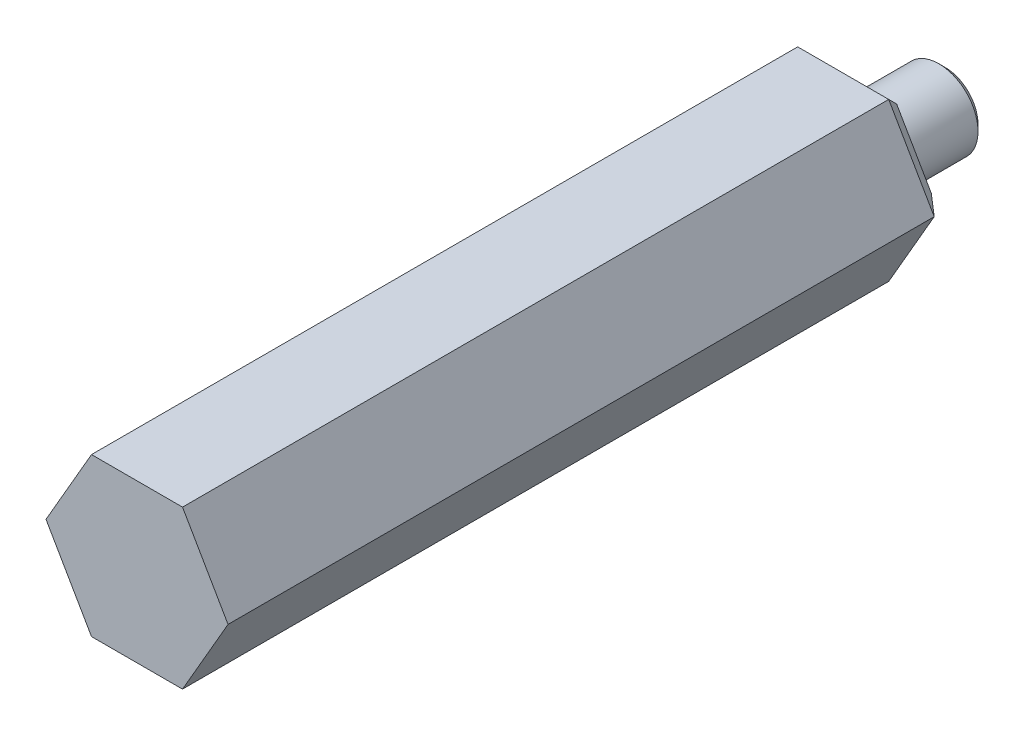
ISO-10303-21;
HEADER;
FILE_DESCRIPTION(('STEP AP214'),'2;1');
FILE_NAME('part.step','',(''),(''),'','','');
FILE_SCHEMA(('AUTOMOTIVE_DESIGN { 1 0 10303 214 1 1 1 1 }'));
ENDSEC;
DATA;
#1=APPLICATION_CONTEXT('core data for automotive mechanical design processes');
#2=APPLICATION_PROTOCOL_DEFINITION('international standard','automotive_design',2000,#1);
#3=PRODUCT_CONTEXT('',#1,'mechanical');
#4=PRODUCT('Part','Part','',(#3));
#5=PRODUCT_RELATED_PRODUCT_CATEGORY('part','',(#4));
#6=PRODUCT_DEFINITION_FORMATION('','',#4);
#7=PRODUCT_DEFINITION_CONTEXT('part definition',#1,'design');
#8=PRODUCT_DEFINITION('design','',#6,#7);
#9=PRODUCT_DEFINITION_SHAPE('','',#8);
#10=(LENGTH_UNIT() NAMED_UNIT(*) SI_UNIT(.MILLI.,.METRE.));
#11=(NAMED_UNIT(*) PLANE_ANGLE_UNIT() SI_UNIT($,.RADIAN.));
#12=(NAMED_UNIT(*) SI_UNIT($,.STERADIAN.) SOLID_ANGLE_UNIT());
#13=UNCERTAINTY_MEASURE_WITH_UNIT(LENGTH_MEASURE(1.E-05),#10,'distance_accuracy_value','');
#14=(GEOMETRIC_REPRESENTATION_CONTEXT(3) GLOBAL_UNCERTAINTY_ASSIGNED_CONTEXT((#13)) GLOBAL_UNIT_ASSIGNED_CONTEXT((#10,
#11,#12)) REPRESENTATION_CONTEXT('',''));
#15=CARTESIAN_POINT('',(0.,0.,0.));
#16=DIRECTION('',(0.,0.,1.));
#17=DIRECTION('',(1.,0.,0.));
#18=AXIS2_PLACEMENT_3D('',#15,#16,#17);
#19=CARTESIAN_POINT('',(7.366,0.,29.337));
#20=DIRECTION('',(0.,0.,-1.));
#21=DIRECTION('',(-1.,0.,0.));
#22=AXIS2_PLACEMENT_3D('',#19,#20,#21);
#23=PLANE('',#22);
#24=DIRECTION('',(-0.5,0.866025403784439,0.));
#25=VECTOR('',#24,1.);
#26=CARTESIAN_POINT('',(5.5245,3.18957156213808,29.337));
#27=LINE('',#26,#25);
#28=CARTESIAN_POINT('',(7.366,0.,29.337));
#29=VERTEX_POINT('',#28);
#30=CARTESIAN_POINT('',(3.683,6.37914312427617,29.337));
#31=VERTEX_POINT('',#30);
#32=EDGE_CURVE('E123',#29,#31,#27,.T.);
#33=ORIENTED_EDGE('',*,*,#32,.T.);
#34=DIRECTION('',(-1.,0.,0.));
#35=VECTOR('',#34,1.);
#36=CARTESIAN_POINT('',(0.,6.37914312427617,29.337));
#37=LINE('',#36,#35);
#38=CARTESIAN_POINT('',(-3.68299999999998,6.37914312427617,29.337));
#39=VERTEX_POINT('',#38);
#40=EDGE_CURVE('E135',#31,#39,#37,.T.);
#41=ORIENTED_EDGE('',*,*,#40,.T.);
#42=DIRECTION('',(-0.5,-0.866025403784439,0.));
#43=VECTOR('',#42,1.);
#44=CARTESIAN_POINT('',(-5.52449999999999,3.18957156213808,29.337));
#45=LINE('',#44,#43);
#46=CARTESIAN_POINT('',(-7.36599999999998,0.,29.337));
#47=VERTEX_POINT('',#46);
#48=EDGE_CURVE('E143',#39,#47,#45,.T.);
#49=ORIENTED_EDGE('',*,*,#48,.T.);
#50=DIRECTION('',(0.5,-0.866025403784439,0.));
#51=VECTOR('',#50,1.);
#52=CARTESIAN_POINT('',(-5.52449999999999,-3.18957156213808,29.337));
#53=LINE('',#52,#51);
#54=CARTESIAN_POINT('',(-3.683,-6.37914312427616,29.337));
#55=VERTEX_POINT('',#54);
#56=EDGE_CURVE('E211',#47,#55,#53,.T.);
#57=ORIENTED_EDGE('',*,*,#56,.T.);
#58=DIRECTION('',(1.,0.,0.));
#59=VECTOR('',#58,1.);
#60=CARTESIAN_POINT('',(0.,-6.37914312427617,29.337));
#61=LINE('',#60,#59);
#62=CARTESIAN_POINT('',(3.68299999999999,-6.37914312427618,29.337));
#63=VERTEX_POINT('',#62);
#64=EDGE_CURVE('E210',#55,#63,#61,.T.);
#65=ORIENTED_EDGE('',*,*,#64,.T.);
#66=DIRECTION('',(0.5,0.866025403784439,0.));
#67=VECTOR('',#66,1.);
#68=CARTESIAN_POINT('',(5.5245,-3.18957156213809,29.337));
#69=LINE('',#68,#67);
#70=EDGE_CURVE('E137',#63,#29,#69,.T.);
#71=ORIENTED_EDGE('',*,*,#70,.T.);
#72=EDGE_LOOP('',(#33,#41,#49,#57,#65,#71));
#73=FACE_BOUND('',#72,.T.);
#74=ADVANCED_FACE('F47',(#73),#23,.F.);
#75=CARTESIAN_POINT('',(7.366,0.,-29.337));
#76=DIRECTION('',(0.,0.,1.));
#77=DIRECTION('',(1.,0.,0.));
#78=AXIS2_PLACEMENT_3D('',#75,#76,#77);
#79=PLANE('',#78);
#80=DIRECTION('',(1.,0.,0.));
#81=VECTOR('',#80,1.);
#82=CARTESIAN_POINT('',(3.683,4.85514312427617,-29.337));
#83=LINE('',#82,#81);
#84=CARTESIAN_POINT('',(-2.803118189755,4.85514312427617,-29.337));
#85=VERTEX_POINT('',#84);
#86=CARTESIAN_POINT('',(2.80311818975501,4.85514312427617,-29.337));
#87=VERTEX_POINT('',#86);
#88=EDGE_CURVE('E155',#85,#87,#83,.T.);
#89=ORIENTED_EDGE('',*,*,#88,.T.);
#90=DIRECTION('',(0.5,-0.866025403784439,0.));
#91=VECTOR('',#90,1.);
#92=CARTESIAN_POINT('',(6.04617728463251,-0.762000000000002,-29.337));
#93=LINE('',#92,#91);
#94=CARTESIAN_POINT('',(5.60623637951001,0.,-29.337));
#95=VERTEX_POINT('',#94);
#96=EDGE_CURVE('E165',#87,#95,#93,.T.);
#97=ORIENTED_EDGE('',*,*,#96,.T.);
#98=DIRECTION('',(-0.5,-0.866025403784438,0.));
#99=VECTOR('',#98,1.);
#100=CARTESIAN_POINT('',(2.36317728463251,-5.61714312427618,-29.337));
#101=LINE('',#100,#99);
#102=CARTESIAN_POINT('',(2.80311818975501,-4.85514312427617,-29.337));
#103=VERTEX_POINT('',#102);
#104=EDGE_CURVE('E163',#95,#103,#101,.T.);
#105=ORIENTED_EDGE('',*,*,#104,.T.);
#106=DIRECTION('',(-1.,0.,0.));
#107=VECTOR('',#106,1.);
#108=CARTESIAN_POINT('',(-3.683,-4.85514312427617,-29.337));
#109=LINE('',#108,#107);
#110=CARTESIAN_POINT('',(-2.80311818975501,-4.85514312427617,-29.337));
#111=VERTEX_POINT('',#110);
#112=EDGE_CURVE('E161',#103,#111,#109,.T.);
#113=ORIENTED_EDGE('',*,*,#112,.T.);
#114=DIRECTION('',(-0.5,0.866025403784439,0.));
#115=VECTOR('',#114,1.);
#116=CARTESIAN_POINT('',(-6.04617728463251,0.76200000000001,-29.337));
#117=LINE('',#116,#115);
#118=CARTESIAN_POINT('',(-5.60623637951001,0.,-29.337));
#119=VERTEX_POINT('',#118);
#120=EDGE_CURVE('E159',#111,#119,#117,.T.);
#121=ORIENTED_EDGE('',*,*,#120,.T.);
#122=DIRECTION('',(0.5,0.866025403784439,0.));
#123=VECTOR('',#122,1.);
#124=CARTESIAN_POINT('',(-2.3631772846325,5.61714312427618,-29.337));
#125=LINE('',#124,#123);
#126=EDGE_CURVE('E157',#119,#85,#125,.T.);
#127=ORIENTED_EDGE('',*,*,#126,.T.);
#128=EDGE_LOOP('',(#89,#97,#105,#113,#121,#127));
#129=FACE_BOUND('',#128,.T.);
#130=CARTESIAN_POINT('',(0.,0.,-29.337));
#131=DIRECTION('',(0.,0.,-1.));
#132=DIRECTION('',(-1.,0.,0.));
#133=AXIS2_PLACEMENT_3D('',#130,#131,#132);
#134=CIRCLE('',#133,3.1623);
#135=CARTESIAN_POINT('',(-3.1623,0.,-29.337));
#136=VERTEX_POINT('',#135);
#137=EDGE_CURVE('E128',#136,#136,#134,.T.);
#138=ORIENTED_EDGE('',*,*,#137,.F.);
#139=EDGE_LOOP('',(#138));
#140=FACE_BOUND('',#139,.T.);
#141=ADVANCED_FACE('F232',(#129,#140),#79,.F.);
#142=CARTESIAN_POINT('',(0.,0.,-36.068));
#143=DIRECTION('',(0.,0.,-1.));
#144=DIRECTION('',(-1.,0.,0.));
#145=AXIS2_PLACEMENT_3D('',#142,#143,#144);
#146=CYLINDRICAL_SURFACE('',#145,3.1623);
#147=CARTESIAN_POINT('',(0.,0.,-35.55998635));
#148=DIRECTION('',(0.,0.,1.));
#149=DIRECTION('',(1.,0.,0.));
#150=AXIS2_PLACEMENT_3D('',#147,#148,#149);
#151=CIRCLE('',#150,3.1623);
#152=CARTESIAN_POINT('',(3.1623,0.,-35.55998635));
#153=VERTEX_POINT('',#152);
#154=EDGE_CURVE('E152',#153,#153,#151,.T.);
#155=ORIENTED_EDGE('',*,*,#154,.T.);
#156=EDGE_LOOP('',(#155));
#157=FACE_BOUND('',#156,.T.);
#158=ORIENTED_EDGE('',*,*,#137,.T.);
#159=EDGE_LOOP('',(#158));
#160=FACE_BOUND('',#159,.T.);
#161=ADVANCED_FACE('F251',(#157,#160),#146,.T.);
#162=CARTESIAN_POINT('',(3.1623,0.,-36.068));
#163=DIRECTION('',(0.,0.,1.));
#164=DIRECTION('',(1.,0.,0.));
#165=AXIS2_PLACEMENT_3D('',#162,#163,#164);
#166=PLANE('',#165);
#167=CARTESIAN_POINT('',(0.,0.,-36.068));
#168=DIRECTION('',(0.,0.,1.));
#169=DIRECTION('',(1.,0.,0.));
#170=AXIS2_PLACEMENT_3D('',#167,#168,#169);
#171=CIRCLE('',#170,2.65428635);
#172=CARTESIAN_POINT('',(2.65428635,0.,-36.068));
#173=VERTEX_POINT('',#172);
#174=EDGE_CURVE('E149',#173,#173,#171,.F.);
#175=ORIENTED_EDGE('',*,*,#174,.T.);
#176=EDGE_LOOP('',(#175));
#177=FACE_BOUND('',#176,.T.);
#178=ADVANCED_FACE('F258',(#177),#166,.F.);
#179=CARTESIAN_POINT('',(0.,0.,-36.068));
#180=DIRECTION('',(0.,0.,1.));
#181=DIRECTION('',(1.,0.,0.));
#182=AXIS2_PLACEMENT_3D('',#179,#180,#181);
#183=CONICAL_SURFACE('',#182,2.65428635,0.785398163397449);
#184=ORIENTED_EDGE('',*,*,#154,.F.);
#185=EDGE_LOOP('',(#184));
#186=FACE_BOUND('',#185,.T.);
#187=ORIENTED_EDGE('',*,*,#174,.F.);
#188=EDGE_LOOP('',(#187));
#189=FACE_BOUND('',#188,.T.);
#190=ADVANCED_FACE('F255',(#186,#189),#183,.T.);
#191=CARTESIAN_POINT('',(0.,6.37914312427617,29.338));
#192=DIRECTION('',(0.,1.,0.));
#193=DIRECTION('',(0.,0.,1.));
#194=AXIS2_PLACEMENT_3D('',#191,#192,#193);
#195=PLANE('',#194);
#196=DIRECTION('',(0.,0.,-1.));
#197=VECTOR('',#196,1.);
#198=CARTESIAN_POINT('',(3.683,6.37914312427617,29.338));
#199=LINE('',#198,#197);
#200=CARTESIAN_POINT('',(3.683,6.37914312427617,-27.813));
#201=VERTEX_POINT('',#200);
#202=EDGE_CURVE('E119',#31,#201,#199,.T.);
#203=ORIENTED_EDGE('',*,*,#202,.T.);
#204=DIRECTION('',(-1.,0.,0.));
#205=VECTOR('',#204,1.);
#206=CARTESIAN_POINT('',(-3.68299999999999,6.37914312427617,-27.813));
#207=LINE('',#206,#205);
#208=CARTESIAN_POINT('',(-3.68299999999999,6.37914312427618,-27.813));
#209=VERTEX_POINT('',#208);
#210=EDGE_CURVE('E12',#201,#209,#207,.T.);
#211=ORIENTED_EDGE('',*,*,#210,.T.);
#212=DIRECTION('',(0.,0.,-1.));
#213=VECTOR('',#212,1.);
#214=CARTESIAN_POINT('',(-3.68299999999999,6.37914312427618,29.338));
#215=LINE('',#214,#213);
#216=EDGE_CURVE('E129',#39,#209,#215,.T.);
#217=ORIENTED_EDGE('',*,*,#216,.F.);
#218=ORIENTED_EDGE('',*,*,#40,.F.);
#219=EDGE_LOOP('',(#203,#211,#217,#218));
#220=FACE_BOUND('',#219,.T.);
#221=ADVANCED_FACE('F139',(#220),#195,.T.);
#222=CARTESIAN_POINT('',(-5.52449999999999,3.18957156213808,29.338));
#223=DIRECTION('',(-0.866025403784438,0.5,0.));
#224=DIRECTION('',(-0.5,-0.866025403784439,0.));
#225=AXIS2_PLACEMENT_3D('',#222,#223,#224);
#226=PLANE('',#225);
#227=ORIENTED_EDGE('',*,*,#216,.T.);
#228=DIRECTION('',(-0.5,-0.866025403784439,0.));
#229=VECTOR('',#228,1.);
#230=CARTESIAN_POINT('',(-7.36599999999999,0.,-27.813));
#231=LINE('',#230,#229);
#232=CARTESIAN_POINT('',(-7.366,0.,-27.813));
#233=VERTEX_POINT('',#232);
#234=EDGE_CURVE('E56',#209,#233,#231,.T.);
#235=ORIENTED_EDGE('',*,*,#234,.T.);
#236=DIRECTION('',(0.,0.,-1.));
#237=VECTOR('',#236,1.);
#238=CARTESIAN_POINT('',(-7.366,0.,29.338));
#239=LINE('',#238,#237);
#240=EDGE_CURVE('E140',#47,#233,#239,.T.);
#241=ORIENTED_EDGE('',*,*,#240,.F.);
#242=ORIENTED_EDGE('',*,*,#48,.F.);
#243=EDGE_LOOP('',(#227,#235,#241,#242));
#244=FACE_BOUND('',#243,.T.);
#245=ADVANCED_FACE('F325',(#244),#226,.T.);
#246=CARTESIAN_POINT('',(-5.52449999999999,-3.18957156213808,29.338));
#247=DIRECTION('',(-0.866025403784439,-0.5,0.));
#248=DIRECTION('',(0.5,-0.866025403784439,0.));
#249=AXIS2_PLACEMENT_3D('',#246,#247,#248);
#250=PLANE('',#249);
#251=ORIENTED_EDGE('',*,*,#240,.T.);
#252=DIRECTION('',(0.5,-0.866025403784439,0.));
#253=VECTOR('',#252,1.);
#254=CARTESIAN_POINT('',(-3.683,-6.37914312427617,-27.813));
#255=LINE('',#254,#253);
#256=CARTESIAN_POINT('',(-3.683,-6.37914312427617,-27.813));
#257=VERTEX_POINT('',#256);
#258=EDGE_CURVE('E173',#233,#257,#255,.T.);
#259=ORIENTED_EDGE('',*,*,#258,.T.);
#260=DIRECTION('',(0.,0.,-1.));
#261=VECTOR('',#260,1.);
#262=CARTESIAN_POINT('',(-3.683,-6.37914312427617,29.338));
#263=LINE('',#262,#261);
#264=EDGE_CURVE('E204',#55,#257,#263,.T.);
#265=ORIENTED_EDGE('',*,*,#264,.F.);
#266=ORIENTED_EDGE('',*,*,#56,.F.);
#267=EDGE_LOOP('',(#251,#259,#265,#266));
#268=FACE_BOUND('',#267,.T.);
#269=ADVANCED_FACE('F203',(#268),#250,.T.);
#270=CARTESIAN_POINT('',(0.,-6.37914312427617,29.338));
#271=DIRECTION('',(0.,-1.,0.));
#272=DIRECTION('',(0.,0.,-1.));
#273=AXIS2_PLACEMENT_3D('',#270,#271,#272);
#274=PLANE('',#273);
#275=ORIENTED_EDGE('',*,*,#264,.T.);
#276=DIRECTION('',(1.,0.,0.));
#277=VECTOR('',#276,1.);
#278=CARTESIAN_POINT('',(3.68299999999999,-6.37914312427617,-27.813));
#279=LINE('',#278,#277);
#280=CARTESIAN_POINT('',(3.68299999999999,-6.37914312427618,-27.813));
#281=VERTEX_POINT('',#280);
#282=EDGE_CURVE('E171',#257,#281,#279,.T.);
#283=ORIENTED_EDGE('',*,*,#282,.T.);
#284=DIRECTION('',(0.,0.,-1.));
#285=VECTOR('',#284,1.);
#286=CARTESIAN_POINT('',(3.68299999999999,-6.37914312427618,29.338));
#287=LINE('',#286,#285);
#288=EDGE_CURVE('E213',#63,#281,#287,.T.);
#289=ORIENTED_EDGE('',*,*,#288,.F.);
#290=ORIENTED_EDGE('',*,*,#64,.F.);
#291=EDGE_LOOP('',(#275,#283,#289,#290));
#292=FACE_BOUND('',#291,.T.);
#293=ADVANCED_FACE('F207',(#292),#274,.T.);
#294=CARTESIAN_POINT('',(5.5245,-3.18957156213809,29.338));
#295=DIRECTION('',(0.866025403784438,-0.5,0.));
#296=DIRECTION('',(0.5,0.866025403784439,0.));
#297=AXIS2_PLACEMENT_3D('',#294,#295,#296);
#298=PLANE('',#297);
#299=ORIENTED_EDGE('',*,*,#288,.T.);
#300=DIRECTION('',(0.5,0.866025403784439,0.));
#301=VECTOR('',#300,1.);
#302=CARTESIAN_POINT('',(7.366,0.,-27.813));
#303=LINE('',#302,#301);
#304=CARTESIAN_POINT('',(7.366,0.,-27.813));
#305=VERTEX_POINT('',#304);
#306=EDGE_CURVE('E169',#281,#305,#303,.T.);
#307=ORIENTED_EDGE('',*,*,#306,.T.);
#308=DIRECTION('',(0.,0.,-1.));
#309=VECTOR('',#308,1.);
#310=CARTESIAN_POINT('',(7.366,0.,29.338));
#311=LINE('',#310,#309);
#312=EDGE_CURVE('E217',#29,#305,#311,.T.);
#313=ORIENTED_EDGE('',*,*,#312,.F.);
#314=ORIENTED_EDGE('',*,*,#70,.F.);
#315=EDGE_LOOP('',(#299,#307,#313,#314));
#316=FACE_BOUND('',#315,.T.);
#317=ADVANCED_FACE('F300',(#316),#298,.T.);
#318=CARTESIAN_POINT('',(5.5245,3.18957156213808,29.338));
#319=DIRECTION('',(0.866025403784439,0.5,0.));
#320=DIRECTION('',(-0.5,0.866025403784439,0.));
#321=AXIS2_PLACEMENT_3D('',#318,#319,#320);
#322=PLANE('',#321);
#323=ORIENTED_EDGE('',*,*,#312,.T.);
#324=DIRECTION('',(-0.5,0.866025403784439,0.));
#325=VECTOR('',#324,1.);
#326=CARTESIAN_POINT('',(3.683,6.37914312427617,-27.813));
#327=LINE('',#326,#325);
#328=EDGE_CURVE('E126',#305,#201,#327,.T.);
#329=ORIENTED_EDGE('',*,*,#328,.T.);
#330=ORIENTED_EDGE('',*,*,#202,.F.);
#331=ORIENTED_EDGE('',*,*,#32,.F.);
#332=EDGE_LOOP('',(#323,#329,#330,#331));
#333=FACE_BOUND('',#332,.T.);
#334=ADVANCED_FACE('F122',(#333),#322,.T.);
#335=CARTESIAN_POINT('',(-2.36317728463251,-5.61714312427617,-29.337));
#336=DIRECTION('',(-0.612372435695796,-0.353553390593274,-0.707106781186546));
#337=DIRECTION('',(0.5,-0.866025403784439,0.));
#338=AXIS2_PLACEMENT_3D('',#335,#336,#337);
#339=PLANE('',#338);
#340=DIRECTION('',(-0.377964473009227,-0.654653670707976,0.654653670707979));
#341=VECTOR('',#340,1.);
#342=CARTESIAN_POINT('',(-2.92881559121857,-5.07285740999045,-29.1192857142857));
#343=LINE('',#342,#341);
#344=EDGE_CURVE('E185',#257,#111,#343,.F.);
#345=ORIENTED_EDGE('',*,*,#344,.F.);
#346=ORIENTED_EDGE('',*,*,#258,.F.);
#347=DIRECTION('',(-0.755928946018453,0.,0.654653670707979));
#348=VECTOR('',#347,1.);
#349=CARTESIAN_POINT('',(-3.75305975386573,0.,-30.9418980355075));
#350=LINE('',#349,#348);
#351=EDGE_CURVE('E51',#119,#233,#350,.T.);
#352=ORIENTED_EDGE('',*,*,#351,.F.);
#353=ORIENTED_EDGE('',*,*,#120,.F.);
#354=EDGE_LOOP('',(#345,#346,#352,#353));
#355=FACE_BOUND('',#354,.T.);
#356=ADVANCED_FACE('F49',(#355),#339,.T.);
#357=CARTESIAN_POINT('',(-2.3631772846325,5.61714312427617,-29.337));
#358=DIRECTION('',(-0.612372435695796,0.353553390593274,-0.707106781186546));
#359=DIRECTION('',(-0.5,-0.866025403784439,0.));
#360=AXIS2_PLACEMENT_3D('',#357,#358,#359);
#361=PLANE('',#360);
#362=ORIENTED_EDGE('',*,*,#351,.T.);
#363=ORIENTED_EDGE('',*,*,#234,.F.);
#364=DIRECTION('',(-0.377964473009227,0.654653670707976,0.654653670707979));
#365=VECTOR('',#364,1.);
#366=CARTESIAN_POINT('',(-1.35038701979,2.33893892815782,-31.8532041961184));
#367=LINE('',#366,#365);
#368=EDGE_CURVE('E183',#85,#209,#367,.T.);
#369=ORIENTED_EDGE('',*,*,#368,.F.);
#370=ORIENTED_EDGE('',*,*,#126,.F.);
#371=EDGE_LOOP('',(#362,#363,#369,#370));
#372=FACE_BOUND('',#371,.T.);
#373=ADVANCED_FACE('F195',(#372),#361,.T.);
#374=CARTESIAN_POINT('',(7.366,-4.85514312427617,-29.337));
#375=DIRECTION('',(0.,-0.707106781186549,-0.707106781186546));
#376=DIRECTION('',(1.,0.,0.));
#377=AXIS2_PLACEMENT_3D('',#374,#375,#376);
#378=PLANE('',#377);
#379=ORIENTED_EDGE('',*,*,#344,.T.);
#380=ORIENTED_EDGE('',*,*,#112,.F.);
#381=DIRECTION('',(0.377964473009226,-0.654653670707976,0.654653670707979));
#382=VECTOR('',#381,1.);
#383=CARTESIAN_POINT('',(3.45495844836143,-5.98416357060133,-28.2079795536748));
#384=LINE('',#383,#382);
#385=EDGE_CURVE('E180',#281,#103,#384,.F.);
#386=ORIENTED_EDGE('',*,*,#385,.F.);
#387=ORIENTED_EDGE('',*,*,#282,.F.);
#388=EDGE_LOOP('',(#379,#380,#386,#387));
#389=FACE_BOUND('',#388,.T.);
#390=ADVANCED_FACE('F238',(#389),#378,.T.);
#391=CARTESIAN_POINT('',(7.366,4.85514312427617,-29.337));
#392=DIRECTION('',(0.,0.707106781186549,-0.707106781186546));
#393=DIRECTION('',(-1.,0.,0.));
#394=AXIS2_PLACEMENT_3D('',#391,#392,#393);
#395=PLANE('',#394);
#396=ORIENTED_EDGE('',*,*,#368,.T.);
#397=ORIENTED_EDGE('',*,*,#210,.F.);
#398=DIRECTION('',(-0.377964473009226,-0.654653670707976,-0.654653670707979));
#399=VECTOR('',#398,1.);
#400=CARTESIAN_POINT('',(3.45495844836143,5.98416357060133,-28.2079795536748));
#401=LINE('',#400,#399);
#402=EDGE_CURVE('E178',#87,#201,#401,.F.);
#403=ORIENTED_EDGE('',*,*,#402,.F.);
#404=ORIENTED_EDGE('',*,*,#88,.F.);
#405=EDGE_LOOP('',(#396,#397,#403,#404));
#406=FACE_BOUND('',#405,.T.);
#407=ADVANCED_FACE('F236',(#406),#395,.T.);
#408=CARTESIAN_POINT('',(6.04617728463251,0.762000000000003,-29.337));
#409=DIRECTION('',(0.612372435695796,-0.353553390593275,-0.707106781186546));
#410=DIRECTION('',(0.5,0.866025403784439,0.));
#411=AXIS2_PLACEMENT_3D('',#408,#409,#410);
#412=PLANE('',#411);
#413=ORIENTED_EDGE('',*,*,#385,.T.);
#414=ORIENTED_EDGE('',*,*,#104,.F.);
#415=DIRECTION('',(0.755928946018453,0.,0.654653670707979));
#416=VECTOR('',#415,1.);
#417=CARTESIAN_POINT('',(5.85763118243715,0.,-29.1192857142857));
#418=LINE('',#417,#416);
#419=EDGE_CURVE('E176',#305,#95,#418,.F.);
#420=ORIENTED_EDGE('',*,*,#419,.F.);
#421=ORIENTED_EDGE('',*,*,#306,.F.);
#422=EDGE_LOOP('',(#413,#414,#420,#421));
#423=FACE_BOUND('',#422,.T.);
#424=ADVANCED_FACE('F229',(#423),#412,.T.);
#425=CARTESIAN_POINT('',(6.04617728463251,-0.762000000000004,-29.337));
#426=DIRECTION('',(0.612372435695796,0.353553390593274,-0.707106781186546));
#427=DIRECTION('',(-0.5,0.866025403784439,0.));
#428=AXIS2_PLACEMENT_3D('',#425,#426,#427);
#429=PLANE('',#428);
#430=ORIENTED_EDGE('',*,*,#402,.T.);
#431=ORIENTED_EDGE('',*,*,#328,.F.);
#432=ORIENTED_EDGE('',*,*,#419,.T.);
#433=ORIENTED_EDGE('',*,*,#96,.F.);
#434=EDGE_LOOP('',(#430,#431,#432,#433));
#435=FACE_BOUND('',#434,.T.);
#436=ADVANCED_FACE('F223',(#435),#429,.T.);
#437=CLOSED_SHELL('',(#74,#141,#161,#178,#190,#221,#245,#269,#293,#317,#334,#356,#373,#390,#407,
#424,#436));
#438=MANIFOLD_SOLID_BREP('B2',#437);
#439=ADVANCED_BREP_SHAPE_REPRESENTATION('',(#18,#438),#14);
#440=SHAPE_DEFINITION_REPRESENTATION(#9,#439);
ENDSEC;
END-ISO-10303-21;
